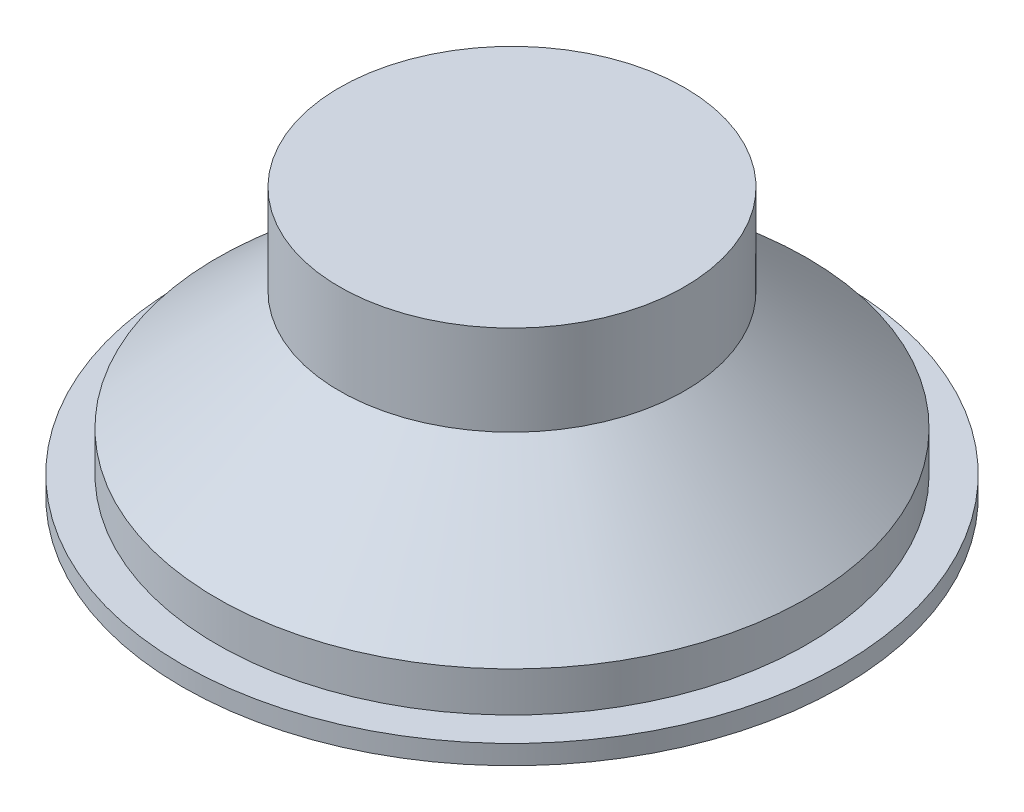
ISO-10303-21;
HEADER;
FILE_DESCRIPTION(('STEP AP214'),'2;1');
FILE_NAME('part.step','',(''),(''),'','','');
FILE_SCHEMA(('AUTOMOTIVE_DESIGN { 1 0 10303 214 1 1 1 1 }'));
ENDSEC;
DATA;
#1=APPLICATION_CONTEXT('core data for automotive mechanical design processes');
#2=APPLICATION_PROTOCOL_DEFINITION('international standard','automotive_design',2000,#1);
#3=PRODUCT_CONTEXT('',#1,'mechanical');
#4=PRODUCT('Part','Part','',(#3));
#5=PRODUCT_RELATED_PRODUCT_CATEGORY('part','',(#4));
#6=PRODUCT_DEFINITION_FORMATION('','',#4);
#7=PRODUCT_DEFINITION_CONTEXT('part definition',#1,'design');
#8=PRODUCT_DEFINITION('design','',#6,#7);
#9=PRODUCT_DEFINITION_SHAPE('','',#8);
#10=(LENGTH_UNIT() NAMED_UNIT(*) SI_UNIT(.MILLI.,.METRE.));
#11=(NAMED_UNIT(*) PLANE_ANGLE_UNIT() SI_UNIT($,.RADIAN.));
#12=(NAMED_UNIT(*) SI_UNIT($,.STERADIAN.) SOLID_ANGLE_UNIT());
#13=UNCERTAINTY_MEASURE_WITH_UNIT(LENGTH_MEASURE(1.E-05),#10,'distance_accuracy_value','');
#14=(GEOMETRIC_REPRESENTATION_CONTEXT(3) GLOBAL_UNCERTAINTY_ASSIGNED_CONTEXT((#13)) GLOBAL_UNIT_ASSIGNED_CONTEXT((#10,
#11,#12)) REPRESENTATION_CONTEXT('',''));
#15=CARTESIAN_POINT('',(0.,0.,0.));
#16=DIRECTION('',(0.,0.,1.));
#17=DIRECTION('',(1.,0.,0.));
#18=AXIS2_PLACEMENT_3D('',#15,#16,#17);
#19=CARTESIAN_POINT('',(0.,104.,0.));
#20=DIRECTION('',(0.,1.,0.));
#21=DIRECTION('',(0.,0.,1.));
#22=AXIS2_PLACEMENT_3D('',#19,#20,#21);
#23=PLANE('',#22);
#24=CARTESIAN_POINT('',(0.,104.,0.));
#25=DIRECTION('',(0.,-1.,0.));
#26=DIRECTION('',(0.,0.,-1.));
#27=AXIS2_PLACEMENT_3D('',#24,#25,#26);
#28=CIRCLE('',#27,67.);
#29=CARTESIAN_POINT('',(0.,104.,-67.));
#30=VERTEX_POINT('',#29);
#31=EDGE_CURVE('E10',#30,#30,#28,.T.);
#32=ORIENTED_EDGE('',*,*,#31,.F.);
#33=EDGE_LOOP('',(#32));
#34=FACE_BOUND('',#33,.T.);
#35=ADVANCED_FACE('F35',(#34),#23,.T.);
#36=CARTESIAN_POINT('',(0.,0.,0.));
#37=DIRECTION('',(0.,-1.,0.));
#38=DIRECTION('',(0.,0.,-1.));
#39=AXIS2_PLACEMENT_3D('',#36,#37,#38);
#40=CYLINDRICAL_SURFACE('',#39,67.);
#41=ORIENTED_EDGE('',*,*,#31,.T.);
#42=EDGE_LOOP('',(#41));
#43=FACE_BOUND('',#42,.T.);
#44=CARTESIAN_POINT('',(0.,69.,0.));
#45=DIRECTION('',(0.,-1.,0.));
#46=DIRECTION('',(0.,0.,-1.));
#47=AXIS2_PLACEMENT_3D('',#44,#45,#46);
#48=CIRCLE('',#47,67.);
#49=CARTESIAN_POINT('',(0.,69.,-67.));
#50=VERTEX_POINT('',#49);
#51=EDGE_CURVE('E41',#50,#50,#48,.T.);
#52=ORIENTED_EDGE('',*,*,#51,.F.);
#53=EDGE_LOOP('',(#52));
#54=FACE_BOUND('',#53,.T.);
#55=ADVANCED_FACE('F90',(#43,#54),#40,.T.);
#56=CARTESIAN_POINT('',(0.,69.,1.9151347174784E-13));
#57=DIRECTION('',(0.,-1.,0.));
#58=DIRECTION('',(0.,0.,-1.));
#59=AXIS2_PLACEMENT_3D('',#56,#57,#58);
#60=PLANE('',#59);
#61=ORIENTED_EDGE('',*,*,#51,.T.);
#62=EDGE_LOOP('',(#61));
#63=FACE_BOUND('',#62,.T.);
#64=CARTESIAN_POINT('',(0.,69.,0.));
#65=DIRECTION('',(0.,-1.,0.));
#66=DIRECTION('',(0.,0.,-1.));
#67=AXIS2_PLACEMENT_3D('',#64,#65,#66);
#68=CIRCLE('',#67,62.);
#69=CARTESIAN_POINT('',(0.,69.,-62.));
#70=VERTEX_POINT('',#69);
#71=EDGE_CURVE('E45',#70,#70,#68,.T.);
#72=ORIENTED_EDGE('',*,*,#71,.F.);
#73=EDGE_LOOP('',(#72));
#74=FACE_BOUND('',#73,.T.);
#75=ADVANCED_FACE('F95',(#63,#74),#60,.T.);
#76=CARTESIAN_POINT('',(0.,23.,0.));
#77=DIRECTION('',(0.,-1.,0.));
#78=DIRECTION('',(0.,0.,-1.));
#79=AXIS2_PLACEMENT_3D('',#76,#77,#78);
#80=CONICAL_SURFACE('',#79,114.5,0.851292472827827);
#81=ORIENTED_EDGE('',*,*,#71,.T.);
#82=EDGE_LOOP('',(#81));
#83=FACE_BOUND('',#82,.T.);
#84=CARTESIAN_POINT('',(0.,23.,0.));
#85=DIRECTION('',(0.,-1.,0.));
#86=DIRECTION('',(0.,0.,-1.));
#87=AXIS2_PLACEMENT_3D('',#84,#85,#86);
#88=CIRCLE('',#87,114.5);
#89=CARTESIAN_POINT('',(0.,23.,-114.5));
#90=VERTEX_POINT('',#89);
#91=EDGE_CURVE('E49',#90,#90,#88,.T.);
#92=ORIENTED_EDGE('',*,*,#91,.F.);
#93=EDGE_LOOP('',(#92));
#94=FACE_BOUND('',#93,.T.);
#95=ADVANCED_FACE('F99',(#83,#94),#80,.T.);
#96=CARTESIAN_POINT('',(0.,0.,0.));
#97=DIRECTION('',(0.,-1.,0.));
#98=DIRECTION('',(0.,0.,-1.));
#99=AXIS2_PLACEMENT_3D('',#96,#97,#98);
#100=CYLINDRICAL_SURFACE('',#99,114.5);
#101=ORIENTED_EDGE('',*,*,#91,.T.);
#102=EDGE_LOOP('',(#101));
#103=FACE_BOUND('',#102,.T.);
#104=CARTESIAN_POINT('',(0.,7.5,0.));
#105=DIRECTION('',(0.,-1.,0.));
#106=DIRECTION('',(0.,0.,-1.));
#107=AXIS2_PLACEMENT_3D('',#104,#105,#106);
#108=CIRCLE('',#107,114.5);
#109=CARTESIAN_POINT('',(0.,7.5,-114.5));
#110=VERTEX_POINT('',#109);
#111=EDGE_CURVE('E54',#110,#110,#108,.T.);
#112=ORIENTED_EDGE('',*,*,#111,.F.);
#113=EDGE_LOOP('',(#112));
#114=FACE_BOUND('',#113,.T.);
#115=ADVANCED_FACE('F105',(#103,#114),#100,.T.);
#116=CARTESIAN_POINT('',(0.,7.5,0.));
#117=DIRECTION('',(0.,1.,0.));
#118=DIRECTION('',(0.,0.,1.));
#119=AXIS2_PLACEMENT_3D('',#116,#117,#118);
#120=PLANE('',#119);
#121=ORIENTED_EDGE('',*,*,#111,.T.);
#122=EDGE_LOOP('',(#121));
#123=FACE_BOUND('',#122,.T.);
#124=CARTESIAN_POINT('',(0.,7.5,0.));
#125=DIRECTION('',(0.,-1.,0.));
#126=DIRECTION('',(0.,0.,-1.));
#127=AXIS2_PLACEMENT_3D('',#124,#125,#126);
#128=CIRCLE('',#127,128.);
#129=CARTESIAN_POINT('',(0.,7.5,-128.));
#130=VERTEX_POINT('',#129);
#131=EDGE_CURVE('E57',#130,#130,#128,.T.);
#132=ORIENTED_EDGE('',*,*,#131,.F.);
#133=EDGE_LOOP('',(#132));
#134=FACE_BOUND('',#133,.T.);
#135=ADVANCED_FACE('F86',(#123,#134),#120,.T.);
#136=CARTESIAN_POINT('',(0.,0.,0.));
#137=DIRECTION('',(0.,-1.,0.));
#138=DIRECTION('',(0.,0.,-1.));
#139=AXIS2_PLACEMENT_3D('',#136,#137,#138);
#140=CYLINDRICAL_SURFACE('',#139,128.);
#141=ORIENTED_EDGE('',*,*,#131,.T.);
#142=EDGE_LOOP('',(#141));
#143=FACE_BOUND('',#142,.T.);
#144=CARTESIAN_POINT('',(0.,0.,0.));
#145=DIRECTION('',(0.,-1.,0.));
#146=DIRECTION('',(0.,0.,-1.));
#147=AXIS2_PLACEMENT_3D('',#144,#145,#146);
#148=CIRCLE('',#147,128.);
#149=CARTESIAN_POINT('',(0.,0.,-128.));
#150=VERTEX_POINT('',#149);
#151=EDGE_CURVE('E60',#150,#150,#148,.T.);
#152=ORIENTED_EDGE('',*,*,#151,.F.);
#153=EDGE_LOOP('',(#152));
#154=FACE_BOUND('',#153,.T.);
#155=ADVANCED_FACE('F80',(#143,#154),#140,.T.);
#156=CARTESIAN_POINT('',(0.,0.,0.));
#157=DIRECTION('',(0.,-1.,0.));
#158=DIRECTION('',(0.,0.,-1.));
#159=AXIS2_PLACEMENT_3D('',#156,#157,#158);
#160=PLANE('',#159);
#161=ORIENTED_EDGE('',*,*,#151,.T.);
#162=EDGE_LOOP('',(#161));
#163=FACE_BOUND('',#162,.T.);
#164=CARTESIAN_POINT('',(0.,0.,0.));
#165=DIRECTION('',(0.,-1.,0.));
#166=DIRECTION('',(0.,0.,-1.));
#167=AXIS2_PLACEMENT_3D('',#164,#165,#166);
#168=CIRCLE('',#167,107.5);
#169=CARTESIAN_POINT('',(0.,0.,-107.5));
#170=VERTEX_POINT('',#169);
#171=EDGE_CURVE('E63',#170,#170,#168,.T.);
#172=ORIENTED_EDGE('',*,*,#171,.F.);
#173=EDGE_LOOP('',(#172));
#174=FACE_BOUND('',#173,.T.);
#175=ADVANCED_FACE('F75',(#163,#174),#160,.T.);
#176=CARTESIAN_POINT('',(0.,0.,0.));
#177=DIRECTION('',(0.,-1.,0.));
#178=DIRECTION('',(0.,0.,-1.));
#179=AXIS2_PLACEMENT_3D('',#176,#177,#178);
#180=CONICAL_SURFACE('',#179,107.5,0.99783018390619);
#181=CARTESIAN_POINT('',(0.,50.,0.));
#182=DIRECTION('',(0.,-1.,0.));
#183=DIRECTION('',(0.,0.,-1.));
#184=AXIS2_PLACEMENT_3D('',#181,#182,#183);
#185=CIRCLE('',#184,30.);
#186=CARTESIAN_POINT('',(0.,50.,-30.));
#187=VERTEX_POINT('',#186);
#188=EDGE_CURVE('E66',#187,#187,#185,.T.);
#189=ORIENTED_EDGE('',*,*,#188,.F.);
#190=EDGE_LOOP('',(#189));
#191=FACE_BOUND('',#190,.T.);
#192=ORIENTED_EDGE('',*,*,#171,.T.);
#193=EDGE_LOOP('',(#192));
#194=FACE_BOUND('',#193,.T.);
#195=ADVANCED_FACE('F72',(#191,#194),#180,.F.);
#196=CARTESIAN_POINT('',(0.,50.,0.));
#197=DIRECTION('',(0.,1.,0.));
#198=DIRECTION('',(0.,0.,1.));
#199=AXIS2_PLACEMENT_3D('',#196,#197,#198);
#200=PLANE('',#199);
#201=ORIENTED_EDGE('',*,*,#188,.T.);
#202=EDGE_LOOP('',(#201));
#203=FACE_BOUND('',#202,.T.);
#204=ADVANCED_FACE('F70',(#203),#200,.F.);
#205=CLOSED_SHELL('',(#35,#55,#75,#95,#115,#135,#155,#175,#195,#204));
#206=MANIFOLD_SOLID_BREP('B2',#205);
#207=ADVANCED_BREP_SHAPE_REPRESENTATION('',(#18,#206),#14);
#208=SHAPE_DEFINITION_REPRESENTATION(#9,#207);
ENDSEC;
END-ISO-10303-21;
